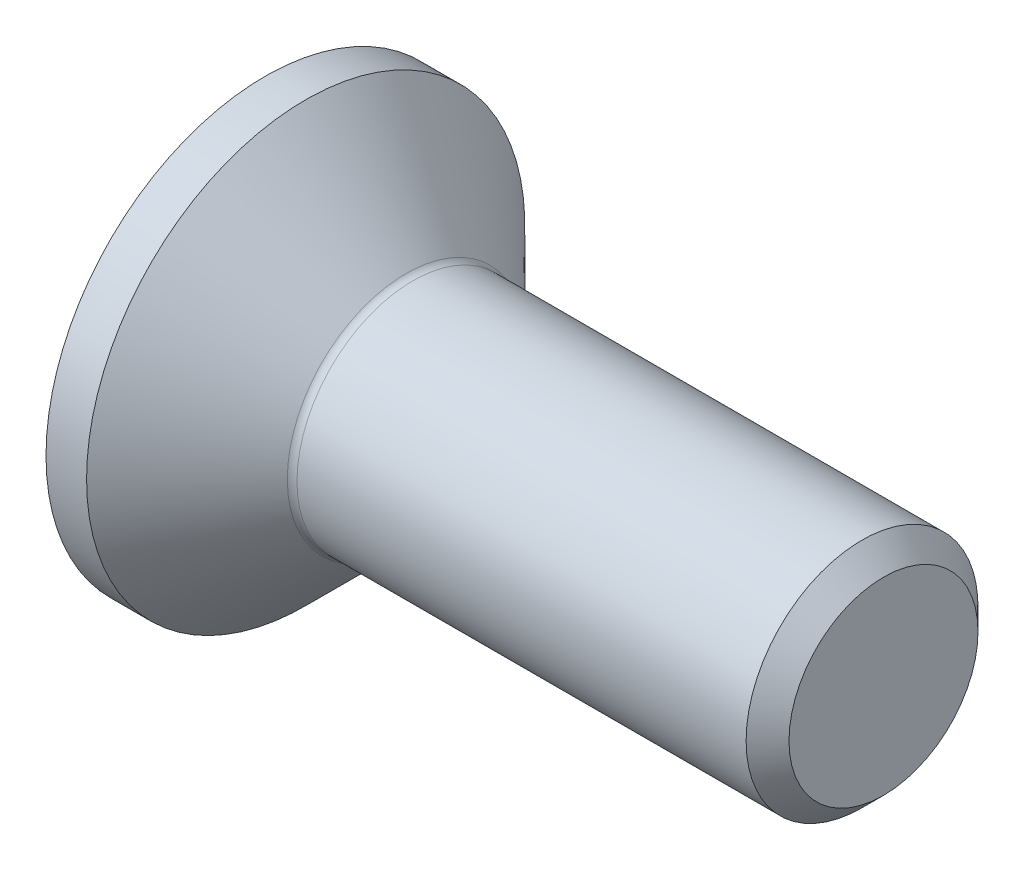
ISO-10303-21;
HEADER;
FILE_DESCRIPTION(('STEP AP214'),'2;1');
FILE_NAME('part.step','',(''),(''),'','','');
FILE_SCHEMA(('AUTOMOTIVE_DESIGN { 1 0 10303 214 1 1 1 1 }'));
ENDSEC;
DATA;
#1=APPLICATION_CONTEXT('core data for automotive mechanical design processes');
#2=APPLICATION_PROTOCOL_DEFINITION('international standard','automotive_design',2000,#1);
#3=PRODUCT_CONTEXT('',#1,'mechanical');
#4=PRODUCT('Part','Part','',(#3));
#5=PRODUCT_RELATED_PRODUCT_CATEGORY('part','',(#4));
#6=PRODUCT_DEFINITION_FORMATION('','',#4);
#7=PRODUCT_DEFINITION_CONTEXT('part definition',#1,'design');
#8=PRODUCT_DEFINITION('design','',#6,#7);
#9=PRODUCT_DEFINITION_SHAPE('','',#8);
#10=(LENGTH_UNIT() NAMED_UNIT(*) SI_UNIT(.MILLI.,.METRE.));
#11=(NAMED_UNIT(*) PLANE_ANGLE_UNIT() SI_UNIT($,.RADIAN.));
#12=(NAMED_UNIT(*) SI_UNIT($,.STERADIAN.) SOLID_ANGLE_UNIT());
#13=UNCERTAINTY_MEASURE_WITH_UNIT(LENGTH_MEASURE(1.E-05),#10,'distance_accuracy_value','');
#14=(GEOMETRIC_REPRESENTATION_CONTEXT(3) GLOBAL_UNCERTAINTY_ASSIGNED_CONTEXT((#13)) GLOBAL_UNIT_ASSIGNED_CONTEXT((#10,
#11,#12)) REPRESENTATION_CONTEXT('',''));
#15=CARTESIAN_POINT('',(0.,0.,0.));
#16=DIRECTION('',(0.,0.,1.));
#17=DIRECTION('',(1.,0.,0.));
#18=AXIS2_PLACEMENT_3D('',#15,#16,#17);
#19=CARTESIAN_POINT('',(2.2,-2.3094010767585,0.));
#20=DIRECTION('',(-1.,0.,0.));
#21=DIRECTION('',(0.,0.,1.));
#22=AXIS2_PLACEMENT_3D('',#19,#20,#21);
#23=PLANE('',#22);
#24=DIRECTION('',(0.,-0.5,-0.866025403784439));
#25=VECTOR('',#24,1.);
#26=CARTESIAN_POINT('',(2.2,1.73205080756888,-1.));
#27=LINE('',#26,#25);
#28=CARTESIAN_POINT('',(2.20000000000809,1.73205080757301,-1.00000000000239));
#29=VERTEX_POINT('',#28);
#30=CARTESIAN_POINT('',(2.2,1.15470053837925,-2.));
#31=VERTEX_POINT('',#30);
#32=EDGE_CURVE('E106',#29,#31,#27,.T.);
#33=ORIENTED_EDGE('',*,*,#32,.T.);
#34=DIRECTION('',(0.,1.,0.));
#35=VECTOR('',#34,1.);
#36=CARTESIAN_POINT('',(2.2,-2.3094010767585,-2.));
#37=LINE('',#36,#35);
#38=CARTESIAN_POINT('',(2.20000000000809,0.,-2.00000000000477));
#39=VERTEX_POINT('',#38);
#40=EDGE_CURVE('E91',#31,#39,#37,.F.);
#41=ORIENTED_EDGE('',*,*,#40,.T.);
#42=CARTESIAN_POINT('',(2.20000000001619,0.,0.));
#43=DIRECTION('',(-1.,0.,0.));
#44=DIRECTION('',(0.,0.,1.));
#45=AXIS2_PLACEMENT_3D('',#42,#43,#44);
#46=CIRCLE('',#45,2.00000000000955);
#47=EDGE_CURVE('E20',#39,#29,#46,.F.);
#48=ORIENTED_EDGE('',*,*,#47,.T.);
#49=EDGE_LOOP('',(#33,#41,#48));
#50=FACE_BOUND('',#49,.T.);
#51=ADVANCED_FACE('F17',(#50),#23,.T.);
#52=CARTESIAN_POINT('',(2.2,-2.3094010767585,0.));
#53=DIRECTION('',(-1.,0.,0.));
#54=DIRECTION('',(0.,0.,1.));
#55=AXIS2_PLACEMENT_3D('',#52,#53,#54);
#56=PLANE('',#55);
#57=DIRECTION('',(0.,0.5,-0.866025403784438));
#58=VECTOR('',#57,1.);
#59=CARTESIAN_POINT('',(2.2,1.73205080756888,1.));
#60=LINE('',#59,#58);
#61=CARTESIAN_POINT('',(2.20000000000809,1.73205080757301,1.00000000000239));
#62=VERTEX_POINT('',#61);
#63=CARTESIAN_POINT('',(2.2,2.3094010767585,0.));
#64=VERTEX_POINT('',#63);
#65=EDGE_CURVE('E107',#62,#64,#60,.T.);
#66=ORIENTED_EDGE('',*,*,#65,.T.);
#67=DIRECTION('',(0.,-0.500000000000001,-0.866025403784438));
#68=VECTOR('',#67,1.);
#69=CARTESIAN_POINT('',(2.2,2.3094010767585,0.));
#70=LINE('',#69,#68);
#71=EDGE_CURVE('E150',#64,#29,#70,.T.);
#72=ORIENTED_EDGE('',*,*,#71,.T.);
#73=CARTESIAN_POINT('',(2.20000000001619,0.,0.));
#74=DIRECTION('',(-1.,0.,0.));
#75=DIRECTION('',(0.,0.,1.));
#76=AXIS2_PLACEMENT_3D('',#73,#74,#75);
#77=CIRCLE('',#76,2.00000000000955);
#78=EDGE_CURVE('E122',#29,#62,#77,.F.);
#79=ORIENTED_EDGE('',*,*,#78,.T.);
#80=EDGE_LOOP('',(#66,#72,#79));
#81=FACE_BOUND('',#80,.T.);
#82=ADVANCED_FACE('F301',(#81),#56,.T.);
#83=CARTESIAN_POINT('',(2.2,-2.3094010767585,0.));
#84=DIRECTION('',(-1.,0.,0.));
#85=DIRECTION('',(0.,0.,1.));
#86=AXIS2_PLACEMENT_3D('',#83,#84,#85);
#87=PLANE('',#86);
#88=DIRECTION('',(0.,1.,0.));
#89=VECTOR('',#88,1.);
#90=CARTESIAN_POINT('',(2.2,-2.3094010767585,2.));
#91=LINE('',#90,#89);
#92=CARTESIAN_POINT('',(2.20000000000809,0.,2.00000000000477));
#93=VERTEX_POINT('',#92);
#94=CARTESIAN_POINT('',(2.2,1.15470053837925,2.));
#95=VERTEX_POINT('',#94);
#96=EDGE_CURVE('E145',#93,#95,#91,.T.);
#97=ORIENTED_EDGE('',*,*,#96,.T.);
#98=DIRECTION('',(0.,0.5,-0.866025403784439));
#99=VECTOR('',#98,1.);
#100=CARTESIAN_POINT('',(2.2,1.15470053837925,2.));
#101=LINE('',#100,#99);
#102=EDGE_CURVE('E140',#95,#62,#101,.T.);
#103=ORIENTED_EDGE('',*,*,#102,.T.);
#104=CARTESIAN_POINT('',(2.20000000001619,0.,0.));
#105=DIRECTION('',(-1.,0.,0.));
#106=DIRECTION('',(0.,0.,1.));
#107=AXIS2_PLACEMENT_3D('',#104,#105,#106);
#108=CIRCLE('',#107,2.00000000000955);
#109=EDGE_CURVE('E123',#62,#93,#108,.F.);
#110=ORIENTED_EDGE('',*,*,#109,.T.);
#111=EDGE_LOOP('',(#97,#103,#110));
#112=FACE_BOUND('',#111,.T.);
#113=ADVANCED_FACE('F203',(#112),#87,.T.);
#114=CARTESIAN_POINT('',(2.2,-2.3094010767585,0.));
#115=DIRECTION('',(-1.,0.,0.));
#116=DIRECTION('',(0.,0.,1.));
#117=AXIS2_PLACEMENT_3D('',#114,#115,#116);
#118=PLANE('',#117);
#119=DIRECTION('',(0.,0.500000000000001,0.866025403784438));
#120=VECTOR('',#119,1.);
#121=CARTESIAN_POINT('',(2.2,-1.73205080756888,1.));
#122=LINE('',#121,#120);
#123=CARTESIAN_POINT('',(2.20000000000809,-1.73205080757301,1.00000000000239));
#124=VERTEX_POINT('',#123);
#125=CARTESIAN_POINT('',(2.2,-1.15470053837925,2.));
#126=VERTEX_POINT('',#125);
#127=EDGE_CURVE('E135',#124,#126,#122,.T.);
#128=ORIENTED_EDGE('',*,*,#127,.T.);
#129=DIRECTION('',(0.,1.,0.));
#130=VECTOR('',#129,1.);
#131=CARTESIAN_POINT('',(2.2,-2.3094010767585,2.));
#132=LINE('',#131,#130);
#133=EDGE_CURVE('E98',#126,#93,#132,.T.);
#134=ORIENTED_EDGE('',*,*,#133,.T.);
#135=CARTESIAN_POINT('',(2.20000000001619,0.,0.));
#136=DIRECTION('',(-1.,0.,0.));
#137=DIRECTION('',(0.,0.,1.));
#138=AXIS2_PLACEMENT_3D('',#135,#136,#137);
#139=CIRCLE('',#138,2.00000000000955);
#140=EDGE_CURVE('E116',#93,#124,#139,.F.);
#141=ORIENTED_EDGE('',*,*,#140,.T.);
#142=EDGE_LOOP('',(#128,#134,#141));
#143=FACE_BOUND('',#142,.T.);
#144=ADVANCED_FACE('F206',(#143),#118,.T.);
#145=CARTESIAN_POINT('',(2.2,-2.3094010767585,0.));
#146=DIRECTION('',(-1.,0.,0.));
#147=DIRECTION('',(0.,0.,1.));
#148=AXIS2_PLACEMENT_3D('',#145,#146,#147);
#149=PLANE('',#148);
#150=DIRECTION('',(0.,1.,0.));
#151=VECTOR('',#150,1.);
#152=CARTESIAN_POINT('',(2.2,-2.3094010767585,-2.));
#153=LINE('',#152,#151);
#154=CARTESIAN_POINT('',(2.2,-1.15470053837925,-2.));
#155=VERTEX_POINT('',#154);
#156=EDGE_CURVE('E88',#39,#155,#153,.F.);
#157=ORIENTED_EDGE('',*,*,#156,.T.);
#158=DIRECTION('',(0.,-0.500000000000001,0.866025403784438));
#159=VECTOR('',#158,1.);
#160=CARTESIAN_POINT('',(2.2,-1.15470053837925,-2.));
#161=LINE('',#160,#159);
#162=CARTESIAN_POINT('',(2.20000000000809,-1.73205080757301,-1.00000000000239));
#163=VERTEX_POINT('',#162);
#164=EDGE_CURVE('E97',#155,#163,#161,.T.);
#165=ORIENTED_EDGE('',*,*,#164,.T.);
#166=CARTESIAN_POINT('',(2.20000000001619,0.,0.));
#167=DIRECTION('',(-1.,0.,0.));
#168=DIRECTION('',(0.,0.,1.));
#169=AXIS2_PLACEMENT_3D('',#166,#167,#168);
#170=CIRCLE('',#169,2.00000000000955);
#171=EDGE_CURVE('E110',#163,#39,#170,.F.);
#172=ORIENTED_EDGE('',*,*,#171,.T.);
#173=EDGE_LOOP('',(#157,#165,#172));
#174=FACE_BOUND('',#173,.T.);
#175=ADVANCED_FACE('F111',(#174),#149,.T.);
#176=CARTESIAN_POINT('',(2.20000000001619,0.,0.));
#177=DIRECTION('',(-1.,0.,0.));
#178=DIRECTION('',(0.,0.,1.));
#179=AXIS2_PLACEMENT_3D('',#176,#177,#178);
#180=CONICAL_SURFACE('',#179,2.00000000000955,1.04719755114751);
#181=CARTESIAN_POINT('',(3.35470053838094,0.,0.));
#182=VERTEX_POINT('',#181);
#183=VERTEX_LOOP('',#182);
#184=FACE_BOUND('',#183,.T.);
#185=ORIENTED_EDGE('',*,*,#47,.F.);
#186=ORIENTED_EDGE('',*,*,#171,.F.);
#187=CARTESIAN_POINT('',(2.20000000001619,0.,0.));
#188=DIRECTION('',(-1.,0.,0.));
#189=DIRECTION('',(0.,0.,1.));
#190=AXIS2_PLACEMENT_3D('',#187,#188,#189);
#191=CIRCLE('',#190,2.00000000000955);
#192=EDGE_CURVE('E115',#124,#163,#191,.F.);
#193=ORIENTED_EDGE('',*,*,#192,.F.);
#194=ORIENTED_EDGE('',*,*,#140,.F.);
#195=ORIENTED_EDGE('',*,*,#109,.F.);
#196=ORIENTED_EDGE('',*,*,#78,.F.);
#197=EDGE_LOOP('',(#185,#186,#193,#194,#195,#196));
#198=FACE_BOUND('',#197,.T.);
#199=ADVANCED_FACE('F119',(#184,#198),#180,.F.);
#200=CARTESIAN_POINT('',(2.2,-2.3094010767585,0.));
#201=DIRECTION('',(-1.,0.,0.));
#202=DIRECTION('',(0.,0.,1.));
#203=AXIS2_PLACEMENT_3D('',#200,#201,#202);
#204=PLANE('',#203);
#205=DIRECTION('',(0.,-0.500000000000001,0.866025403784438));
#206=VECTOR('',#205,1.);
#207=CARTESIAN_POINT('',(2.2,-1.73205080756888,-1.));
#208=LINE('',#207,#206);
#209=CARTESIAN_POINT('',(2.2,-2.3094010767585,0.));
#210=VERTEX_POINT('',#209);
#211=EDGE_CURVE('E197',#163,#210,#208,.T.);
#212=ORIENTED_EDGE('',*,*,#211,.T.);
#213=DIRECTION('',(0.,0.500000000000001,0.866025403784438));
#214=VECTOR('',#213,1.);
#215=CARTESIAN_POINT('',(2.2,-1.15470053837925,2.));
#216=LINE('',#215,#214);
#217=EDGE_CURVE('E212',#124,#210,#216,.F.);
#218=ORIENTED_EDGE('',*,*,#217,.F.);
#219=ORIENTED_EDGE('',*,*,#192,.T.);
#220=EDGE_LOOP('',(#212,#218,#219));
#221=FACE_BOUND('',#220,.T.);
#222=ADVANCED_FACE('F213',(#221),#204,.T.);
#223=CARTESIAN_POINT('',(2.2,-1.15470053837925,2.));
#224=DIRECTION('',(0.,0.866025403784438,-0.500000000000001));
#225=DIRECTION('',(0.,0.500000000000001,0.866025403784438));
#226=AXIS2_PLACEMENT_3D('',#223,#224,#225);
#227=PLANE('',#226);
#228=ORIENTED_EDGE('',*,*,#217,.T.);
#229=DIRECTION('',(1.,0.,0.));
#230=VECTOR('',#229,1.);
#231=CARTESIAN_POINT('',(2.2,-2.3094010767585,0.));
#232=LINE('',#231,#230);
#233=CARTESIAN_POINT('',(0.,-2.3094010767585,0.));
#234=VERTEX_POINT('',#233);
#235=EDGE_CURVE('E167',#234,#210,#232,.T.);
#236=ORIENTED_EDGE('',*,*,#235,.F.);
#237=DIRECTION('',(0.,-0.500000000000001,-0.866025403784438));
#238=VECTOR('',#237,1.);
#239=CARTESIAN_POINT('',(0.,-1.15470053837925,2.));
#240=LINE('',#239,#238);
#241=CARTESIAN_POINT('',(0.,-1.15470053837925,2.));
#242=VERTEX_POINT('',#241);
#243=EDGE_CURVE('E173',#242,#234,#240,.T.);
#244=ORIENTED_EDGE('',*,*,#243,.F.);
#245=DIRECTION('',(-1.,0.,0.));
#246=VECTOR('',#245,1.);
#247=CARTESIAN_POINT('',(2.2,-1.15470053837925,2.));
#248=LINE('',#247,#246);
#249=EDGE_CURVE('E170',#126,#242,#248,.T.);
#250=ORIENTED_EDGE('',*,*,#249,.F.);
#251=ORIENTED_EDGE('',*,*,#127,.F.);
#252=EDGE_LOOP('',(#228,#236,#244,#250,#251));
#253=FACE_BOUND('',#252,.T.);
#254=ADVANCED_FACE('F287',(#253),#227,.T.);
#255=CARTESIAN_POINT('',(2.2,-2.3094010767585,0.));
#256=DIRECTION('',(0.,0.866025403784438,0.500000000000001));
#257=DIRECTION('',(0.,-0.500000000000001,0.866025403784438));
#258=AXIS2_PLACEMENT_3D('',#255,#256,#257);
#259=PLANE('',#258);
#260=ORIENTED_EDGE('',*,*,#164,.F.);
#261=DIRECTION('',(1.,0.,0.));
#262=VECTOR('',#261,1.);
#263=CARTESIAN_POINT('',(2.2,-1.15470053837925,-2.));
#264=LINE('',#263,#262);
#265=CARTESIAN_POINT('',(0.,-1.15470053837925,-2.));
#266=VERTEX_POINT('',#265);
#267=EDGE_CURVE('E94',#266,#155,#264,.T.);
#268=ORIENTED_EDGE('',*,*,#267,.F.);
#269=DIRECTION('',(0.,0.500000000000001,-0.866025403784438));
#270=VECTOR('',#269,1.);
#271=CARTESIAN_POINT('',(0.,-2.3094010767585,0.));
#272=LINE('',#271,#270);
#273=EDGE_CURVE('E227',#234,#266,#272,.T.);
#274=ORIENTED_EDGE('',*,*,#273,.F.);
#275=ORIENTED_EDGE('',*,*,#235,.T.);
#276=ORIENTED_EDGE('',*,*,#211,.F.);
#277=EDGE_LOOP('',(#260,#268,#274,#275,#276));
#278=FACE_BOUND('',#277,.T.);
#279=ADVANCED_FACE('F284',(#278),#259,.T.);
#280=CARTESIAN_POINT('',(2.2,-1.15470053837925,-2.));
#281=DIRECTION('',(0.,0.,1.));
#282=DIRECTION('',(1.,0.,0.));
#283=AXIS2_PLACEMENT_3D('',#280,#281,#282);
#284=PLANE('',#283);
#285=ORIENTED_EDGE('',*,*,#40,.F.);
#286=DIRECTION('',(1.,0.,0.));
#287=VECTOR('',#286,1.);
#288=CARTESIAN_POINT('',(2.2,1.15470053837925,-2.));
#289=LINE('',#288,#287);
#290=CARTESIAN_POINT('',(0.,1.15470053837925,-2.));
#291=VERTEX_POINT('',#290);
#292=EDGE_CURVE('E166',#291,#31,#289,.T.);
#293=ORIENTED_EDGE('',*,*,#292,.F.);
#294=DIRECTION('',(0.,1.,0.));
#295=VECTOR('',#294,1.);
#296=CARTESIAN_POINT('',(0.,0.,-2.));
#297=LINE('',#296,#295);
#298=EDGE_CURVE('E230',#266,#291,#297,.T.);
#299=ORIENTED_EDGE('',*,*,#298,.F.);
#300=ORIENTED_EDGE('',*,*,#267,.T.);
#301=ORIENTED_EDGE('',*,*,#156,.F.);
#302=EDGE_LOOP('',(#285,#293,#299,#300,#301));
#303=FACE_BOUND('',#302,.T.);
#304=ADVANCED_FACE('F90',(#303),#284,.T.);
#305=CARTESIAN_POINT('',(2.2,1.15470053837925,-2.));
#306=DIRECTION('',(0.,-0.866025403784438,0.5));
#307=DIRECTION('',(0.,-0.5,-0.866025403784438));
#308=AXIS2_PLACEMENT_3D('',#305,#306,#307);
#309=PLANE('',#308);
#310=ORIENTED_EDGE('',*,*,#71,.F.);
#311=DIRECTION('',(1.,0.,0.));
#312=VECTOR('',#311,1.);
#313=CARTESIAN_POINT('',(2.2,2.3094010767585,0.));
#314=LINE('',#313,#312);
#315=CARTESIAN_POINT('',(0.,2.3094010767585,0.));
#316=VERTEX_POINT('',#315);
#317=EDGE_CURVE('E177',#316,#64,#314,.T.);
#318=ORIENTED_EDGE('',*,*,#317,.F.);
#319=DIRECTION('',(0.,0.5,0.866025403784438));
#320=VECTOR('',#319,1.);
#321=CARTESIAN_POINT('',(0.,1.15470053837925,-2.));
#322=LINE('',#321,#320);
#323=EDGE_CURVE('E233',#291,#316,#322,.T.);
#324=ORIENTED_EDGE('',*,*,#323,.F.);
#325=ORIENTED_EDGE('',*,*,#292,.T.);
#326=ORIENTED_EDGE('',*,*,#32,.F.);
#327=EDGE_LOOP('',(#310,#318,#324,#325,#326));
#328=FACE_BOUND('',#327,.T.);
#329=ADVANCED_FACE('F278',(#328),#309,.T.);
#330=CARTESIAN_POINT('',(2.2,2.3094010767585,0.));
#331=DIRECTION('',(0.,-0.866025403784439,-0.5));
#332=DIRECTION('',(0.,0.5,-0.866025403784439));
#333=AXIS2_PLACEMENT_3D('',#330,#331,#332);
#334=PLANE('',#333);
#335=ORIENTED_EDGE('',*,*,#102,.F.);
#336=DIRECTION('',(-1.,0.,0.));
#337=VECTOR('',#336,1.);
#338=CARTESIAN_POINT('',(2.2,1.15470053837925,2.));
#339=LINE('',#338,#337);
#340=CARTESIAN_POINT('',(0.,1.15470053837925,2.));
#341=VERTEX_POINT('',#340);
#342=EDGE_CURVE('E35',#341,#95,#339,.F.);
#343=ORIENTED_EDGE('',*,*,#342,.F.);
#344=DIRECTION('',(0.,-0.5,0.866025403784438));
#345=VECTOR('',#344,1.);
#346=CARTESIAN_POINT('',(0.,2.3094010767585,0.));
#347=LINE('',#346,#345);
#348=EDGE_CURVE('E236',#316,#341,#347,.T.);
#349=ORIENTED_EDGE('',*,*,#348,.F.);
#350=ORIENTED_EDGE('',*,*,#317,.T.);
#351=ORIENTED_EDGE('',*,*,#65,.F.);
#352=EDGE_LOOP('',(#335,#343,#349,#350,#351));
#353=FACE_BOUND('',#352,.T.);
#354=ADVANCED_FACE('F275',(#353),#334,.T.);
#355=CARTESIAN_POINT('',(2.2,1.15470053837925,2.));
#356=DIRECTION('',(0.,0.,-1.));
#357=DIRECTION('',(-1.,0.,0.));
#358=AXIS2_PLACEMENT_3D('',#355,#356,#357);
#359=PLANE('',#358);
#360=ORIENTED_EDGE('',*,*,#133,.F.);
#361=ORIENTED_EDGE('',*,*,#249,.T.);
#362=DIRECTION('',(0.,1.,0.));
#363=VECTOR('',#362,1.);
#364=CARTESIAN_POINT('',(0.,0.,2.));
#365=LINE('',#364,#363);
#366=EDGE_CURVE('E195',#341,#242,#365,.F.);
#367=ORIENTED_EDGE('',*,*,#366,.F.);
#368=ORIENTED_EDGE('',*,*,#342,.T.);
#369=ORIENTED_EDGE('',*,*,#96,.F.);
#370=EDGE_LOOP('',(#360,#361,#367,#368,#369));
#371=FACE_BOUND('',#370,.T.);
#372=ADVANCED_FACE('F271',(#371),#359,.T.);
#373=CARTESIAN_POINT('',(0.,0.,0.));
#374=DIRECTION('',(-1.,0.,0.));
#375=DIRECTION('',(0.,0.,1.));
#376=AXIS2_PLACEMENT_3D('',#373,#374,#375);
#377=PLANE('',#376);
#378=ORIENTED_EDGE('',*,*,#348,.T.);
#379=ORIENTED_EDGE('',*,*,#366,.T.);
#380=ORIENTED_EDGE('',*,*,#243,.T.);
#381=ORIENTED_EDGE('',*,*,#273,.T.);
#382=ORIENTED_EDGE('',*,*,#298,.T.);
#383=ORIENTED_EDGE('',*,*,#323,.T.);
#384=EDGE_LOOP('',(#378,#379,#380,#381,#382,#383));
#385=FACE_BOUND('',#384,.T.);
#386=CARTESIAN_POINT('',(0.,0.,0.));
#387=DIRECTION('',(-1.,0.,0.));
#388=DIRECTION('',(0.,0.,1.));
#389=AXIS2_PLACEMENT_3D('',#386,#387,#388);
#390=CIRCLE('',#389,5.67);
#391=CARTESIAN_POINT('',(0.,0.,5.67));
#392=VERTEX_POINT('',#391);
#393=EDGE_CURVE('E192',#392,#392,#390,.F.);
#394=ORIENTED_EDGE('',*,*,#393,.F.);
#395=EDGE_LOOP('',(#394));
#396=FACE_BOUND('',#395,.T.);
#397=ADVANCED_FACE('F267',(#385,#396),#377,.T.);
#398=CARTESIAN_POINT('',(0.,0.,0.));
#399=DIRECTION('',(-1.,0.,0.));
#400=DIRECTION('',(0.,0.,1.));
#401=AXIS2_PLACEMENT_3D('',#398,#399,#400);
#402=CYLINDRICAL_SURFACE('',#401,5.67);
#403=ORIENTED_EDGE('',*,*,#393,.T.);
#404=EDGE_LOOP('',(#403));
#405=FACE_BOUND('',#404,.T.);
#406=CARTESIAN_POINT('',(1.0499999999638,0.,0.));
#407=DIRECTION('',(-1.,0.,0.));
#408=DIRECTION('',(0.,0.,1.));
#409=AXIS2_PLACEMENT_3D('',#406,#407,#408);
#410=CIRCLE('',#409,5.67000000000917);
#411=CARTESIAN_POINT('',(1.0499999999638,0.,5.67000000000917));
#412=VERTEX_POINT('',#411);
#413=EDGE_CURVE('E191',#412,#412,#410,.F.);
#414=ORIENTED_EDGE('',*,*,#413,.F.);
#415=EDGE_LOOP('',(#414));
#416=FACE_BOUND('',#415,.T.);
#417=ADVANCED_FACE('F263',(#405,#416),#402,.T.);
#418=CARTESIAN_POINT('',(16.,2.4455,0.));
#419=DIRECTION('',(1.,0.,0.));
#420=DIRECTION('',(0.,0.,-1.));
#421=AXIS2_PLACEMENT_3D('',#418,#419,#420);
#422=PLANE('',#421);
#423=CARTESIAN_POINT('',(16.0000000000196,0.,0.));
#424=DIRECTION('',(-1.,0.,0.));
#425=DIRECTION('',(0.,-1.,0.));
#426=AXIS2_PLACEMENT_3D('',#423,#424,#425);
#427=CIRCLE('',#426,2.44550000002164);
#428=CARTESIAN_POINT('',(16.0000000000196,-2.44550000002164,0.));
#429=VERTEX_POINT('',#428);
#430=EDGE_CURVE('E187',#429,#429,#427,.T.);
#431=ORIENTED_EDGE('',*,*,#430,.F.);
#432=EDGE_LOOP('',(#431));
#433=FACE_BOUND('',#432,.T.);
#434=ADVANCED_FACE('F259',(#433),#422,.T.);
#435=CARTESIAN_POINT('',(1.0499999999638,0.,0.));
#436=DIRECTION('',(-1.,0.,0.));
#437=DIRECTION('',(0.,0.,1.));
#438=AXIS2_PLACEMENT_3D('',#435,#436,#437);
#439=CONICAL_SURFACE('',#438,5.67000000000917,0.785398163397448);
#440=ORIENTED_EDGE('',*,*,#413,.T.);
#441=EDGE_LOOP('',(#440));
#442=FACE_BOUND('',#441,.T.);
#443=CARTESIAN_POINT('',(3.64677669529669,0.,0.));
#444=DIRECTION('',(-1.,0.,0.));
#445=DIRECTION('',(0.,0.,1.));
#446=AXIS2_PLACEMENT_3D('',#443,#444,#445);
#447=CIRCLE('',#446,3.07322330470331);
#448=CARTESIAN_POINT('',(3.64677669529669,0.,3.07322330470331));
#449=VERTEX_POINT('',#448);
#450=EDGE_CURVE('E190',#449,#449,#447,.T.);
#451=ORIENTED_EDGE('',*,*,#450,.T.);
#452=EDGE_LOOP('',(#451));
#453=FACE_BOUND('',#452,.T.);
#454=ADVANCED_FACE('F255',(#442,#453),#439,.T.);
#455=CARTESIAN_POINT('',(15.4454999999984,0.,0.));
#456=DIRECTION('',(-1.,0.,0.));
#457=DIRECTION('',(0.,-1.,0.));
#458=AXIS2_PLACEMENT_3D('',#455,#456,#457);
#459=CONICAL_SURFACE('',#458,3.00000000004275,0.785398163397448);
#460=CARTESIAN_POINT('',(15.4454999999999,0.,0.));
#461=DIRECTION('',(-1.,0.,0.));
#462=DIRECTION('',(0.,0.,1.));
#463=AXIS2_PLACEMENT_3D('',#460,#461,#462);
#464=CIRCLE('',#463,2.99999999999995);
#465=CARTESIAN_POINT('',(15.4454999999999,0.,2.99999999999995));
#466=VERTEX_POINT('',#465);
#467=EDGE_CURVE('E26',#466,#466,#464,.T.);
#468=ORIENTED_EDGE('',*,*,#467,.F.);
#469=EDGE_LOOP('',(#468));
#470=FACE_BOUND('',#469,.T.);
#471=ORIENTED_EDGE('',*,*,#430,.T.);
#472=EDGE_LOOP('',(#471));
#473=FACE_BOUND('',#472,.T.);
#474=ADVANCED_FACE('F251',(#470,#473),#459,.T.);
#475=CARTESIAN_POINT('',(3.82355339059333,0.,0.));
#476=DIRECTION('',(-1.,0.,0.));
#477=DIRECTION('',(0.,0.,1.));
#478=AXIS2_PLACEMENT_3D('',#475,#476,#477);
#479=TOROIDAL_SURFACE('',#478,3.24999999999995,0.25);
#480=ORIENTED_EDGE('',*,*,#450,.F.);
#481=EDGE_LOOP('',(#480));
#482=FACE_BOUND('',#481,.T.);
#483=CARTESIAN_POINT('',(3.82355339059333,0.,0.));
#484=DIRECTION('',(-1.,0.,0.));
#485=DIRECTION('',(0.,0.,1.));
#486=AXIS2_PLACEMENT_3D('',#483,#484,#485);
#487=CIRCLE('',#486,2.99999999999995);
#488=CARTESIAN_POINT('',(3.82355339059333,0.,2.99999999999995));
#489=VERTEX_POINT('',#488);
#490=EDGE_CURVE('E11',#489,#489,#487,.F.);
#491=ORIENTED_EDGE('',*,*,#490,.F.);
#492=EDGE_LOOP('',(#491));
#493=FACE_BOUND('',#492,.T.);
#494=ADVANCED_FACE('F246',(#482,#493),#479,.F.);
#495=CARTESIAN_POINT('',(0.,0.,0.));
#496=DIRECTION('',(-1.,0.,0.));
#497=DIRECTION('',(0.,0.,1.));
#498=AXIS2_PLACEMENT_3D('',#495,#496,#497);
#499=CYLINDRICAL_SURFACE('',#498,2.99999999999995);
#500=ORIENTED_EDGE('',*,*,#490,.T.);
#501=EDGE_LOOP('',(#500));
#502=FACE_BOUND('',#501,.T.);
#503=ORIENTED_EDGE('',*,*,#467,.T.);
#504=EDGE_LOOP('',(#503));
#505=FACE_BOUND('',#504,.T.);
#506=ADVANCED_FACE('F250',(#502,#505),#499,.T.);
#507=CLOSED_SHELL('',(#51,#82,#113,#144,#175,#199,#222,#254,#279,#304,#329,#354,#372,#397,#417,
#434,#454,#474,#494,#506));
#508=MANIFOLD_SOLID_BREP('B1',#507);
#509=ADVANCED_BREP_SHAPE_REPRESENTATION('',(#18,#508),#14);
#510=SHAPE_DEFINITION_REPRESENTATION(#9,#509);
ENDSEC;
END-ISO-10303-21;
